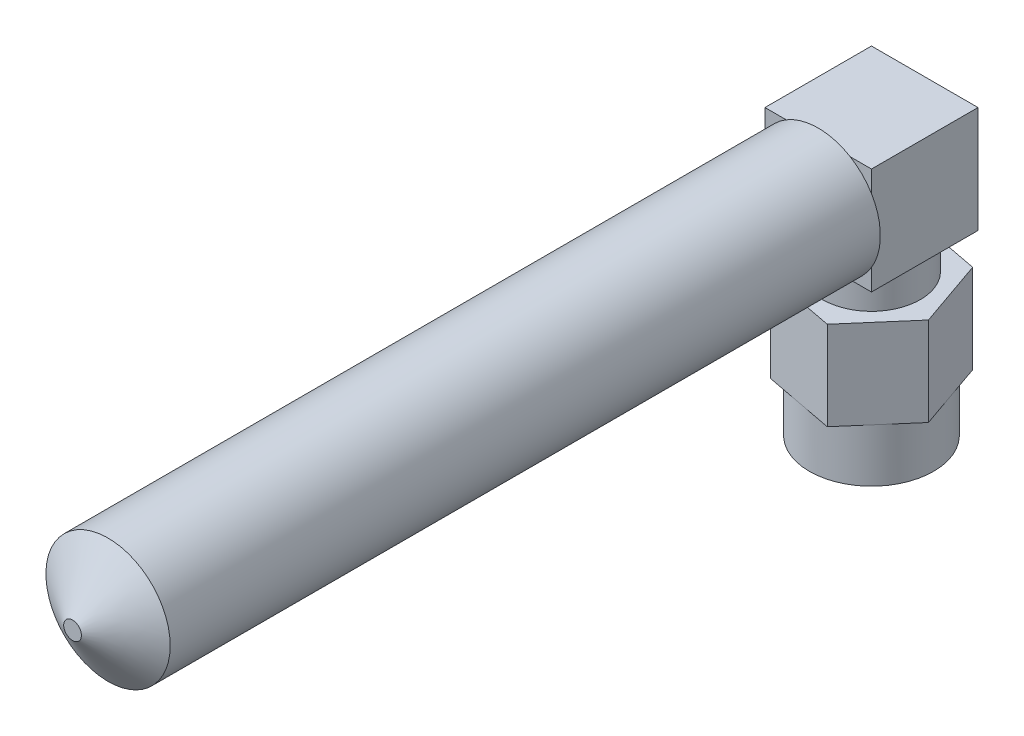
ISO-10303-21;
HEADER;
FILE_DESCRIPTION(('STEP AP214'),'2;1');
FILE_NAME('part.step','',(''),(''),'','','');
FILE_SCHEMA(('AUTOMOTIVE_DESIGN { 1 0 10303 214 1 1 1 1 }'));
ENDSEC;
DATA;
#1=APPLICATION_CONTEXT('core data for automotive mechanical design processes');
#2=APPLICATION_PROTOCOL_DEFINITION('international standard','automotive_design',2000,#1);
#3=PRODUCT_CONTEXT('',#1,'mechanical');
#4=PRODUCT('Part','Part','',(#3));
#5=PRODUCT_RELATED_PRODUCT_CATEGORY('part','',(#4));
#6=PRODUCT_DEFINITION_FORMATION('','',#4);
#7=PRODUCT_DEFINITION_CONTEXT('part definition',#1,'design');
#8=PRODUCT_DEFINITION('design','',#6,#7);
#9=PRODUCT_DEFINITION_SHAPE('','',#8);
#10=(LENGTH_UNIT() NAMED_UNIT(*) SI_UNIT(.MILLI.,.METRE.));
#11=(NAMED_UNIT(*) PLANE_ANGLE_UNIT() SI_UNIT($,.RADIAN.));
#12=(NAMED_UNIT(*) SI_UNIT($,.STERADIAN.) SOLID_ANGLE_UNIT());
#13=UNCERTAINTY_MEASURE_WITH_UNIT(LENGTH_MEASURE(1.E-05),#10,'distance_accuracy_value','');
#14=(GEOMETRIC_REPRESENTATION_CONTEXT(3) GLOBAL_UNCERTAINTY_ASSIGNED_CONTEXT((#13)) GLOBAL_UNIT_ASSIGNED_CONTEXT((#10,
#11,#12)) REPRESENTATION_CONTEXT('',''));
#15=CARTESIAN_POINT('',(0.,0.,0.));
#16=DIRECTION('',(0.,0.,1.));
#17=DIRECTION('',(1.,0.,0.));
#18=AXIS2_PLACEMENT_3D('',#15,#16,#17);
#19=CARTESIAN_POINT('',(3.,16.,3.));
#20=DIRECTION('',(0.,0.,-1.));
#21=DIRECTION('',(-1.,0.,0.));
#22=AXIS2_PLACEMENT_3D('',#19,#20,#21);
#23=PLANE('',#22);
#24=CARTESIAN_POINT('',(0.,13.,3.));
#25=DIRECTION('',(0.,0.,1.));
#26=DIRECTION('',(1.,0.,0.));
#27=AXIS2_PLACEMENT_3D('',#24,#25,#26);
#28=CIRCLE('',#27,3.5);
#29=CARTESIAN_POINT('',(3.,14.802775637732,3.));
#30=VERTEX_POINT('',#29);
#31=CARTESIAN_POINT('',(1.802775637732,16.,3.));
#32=VERTEX_POINT('',#31);
#33=EDGE_CURVE('E185',#30,#32,#28,.T.);
#34=ORIENTED_EDGE('',*,*,#33,.F.);
#35=DIRECTION('',(0.,-1.,0.));
#36=VECTOR('',#35,1.);
#37=CARTESIAN_POINT('',(3.,16.,3.));
#38=LINE('',#37,#36);
#39=CARTESIAN_POINT('',(3.,16.,3.));
#40=VERTEX_POINT('',#39);
#41=EDGE_CURVE('E166',#40,#30,#38,.T.);
#42=ORIENTED_EDGE('',*,*,#41,.F.);
#43=DIRECTION('',(1.,0.,0.));
#44=VECTOR('',#43,1.);
#45=CARTESIAN_POINT('',(3.,16.,3.));
#46=LINE('',#45,#44);
#47=EDGE_CURVE('E622',#32,#40,#46,.T.);
#48=ORIENTED_EDGE('',*,*,#47,.F.);
#49=EDGE_LOOP('',(#34,#42,#48));
#50=FACE_BOUND('',#49,.T.);
#51=ADVANCED_FACE('F36',(#50),#23,.F.);
#52=CARTESIAN_POINT('',(-1.802775637732,16.,3.));
#53=VERTEX_POINT('',#52);
#54=CARTESIAN_POINT('',(-3.,14.802775637732,3.));
#55=VERTEX_POINT('',#54);
#56=EDGE_CURVE('E11',#53,#55,#28,.T.);
#57=ORIENTED_EDGE('',*,*,#56,.F.);
#58=CARTESIAN_POINT('',(-3.,16.,3.));
#59=VERTEX_POINT('',#58);
#60=EDGE_CURVE('E621',#59,#53,#46,.T.);
#61=ORIENTED_EDGE('',*,*,#60,.F.);
#62=DIRECTION('',(0.,-1.,0.));
#63=VECTOR('',#62,1.);
#64=CARTESIAN_POINT('',(-3.,16.,3.));
#65=LINE('',#64,#63);
#66=EDGE_CURVE('E205',#59,#55,#65,.T.);
#67=ORIENTED_EDGE('',*,*,#66,.T.);
#68=EDGE_LOOP('',(#57,#61,#67));
#69=FACE_BOUND('',#68,.T.);
#70=ADVANCED_FACE('F309',(#69),#23,.F.);
#71=CARTESIAN_POINT('',(-3.,11.197224362268,3.));
#72=VERTEX_POINT('',#71);
#73=CARTESIAN_POINT('',(-1.80277563773199,10.,3.));
#74=VERTEX_POINT('',#73);
#75=EDGE_CURVE('E45',#72,#74,#28,.T.);
#76=ORIENTED_EDGE('',*,*,#75,.F.);
#77=CARTESIAN_POINT('',(-3.,10.,3.));
#78=VERTEX_POINT('',#77);
#79=EDGE_CURVE('E206',#72,#78,#65,.T.);
#80=ORIENTED_EDGE('',*,*,#79,.T.);
#81=DIRECTION('',(1.,0.,0.));
#82=VECTOR('',#81,1.);
#83=CARTESIAN_POINT('',(3.,10.,3.));
#84=LINE('',#83,#82);
#85=EDGE_CURVE('E633',#78,#74,#84,.T.);
#86=ORIENTED_EDGE('',*,*,#85,.T.);
#87=EDGE_LOOP('',(#76,#80,#86));
#88=FACE_BOUND('',#87,.T.);
#89=ADVANCED_FACE('F304',(#88),#23,.F.);
#90=CARTESIAN_POINT('',(0.,3.,0.));
#91=DIRECTION('',(0.,-1.,0.));
#92=DIRECTION('',(0.,0.,-1.));
#93=AXIS2_PLACEMENT_3D('',#90,#91,#92);
#94=CYLINDRICAL_SURFACE('',#93,3.5);
#95=CARTESIAN_POINT('',(0.,3.,0.));
#96=DIRECTION('',(0.,1.,0.));
#97=DIRECTION('',(0.,0.,1.));
#98=AXIS2_PLACEMENT_3D('',#95,#96,#97);
#99=CIRCLE('',#98,3.5);
#100=CARTESIAN_POINT('',(2.64807249743795,3.,2.28860482572084));
#101=VERTEX_POINT('',#100);
#102=CARTESIAN_POINT('',(3.30602616701688,3.,-1.14899564098375));
#103=VERTEX_POINT('',#102);
#104=EDGE_CURVE('E191',#101,#103,#99,.T.);
#105=ORIENTED_EDGE('',*,*,#104,.F.);
#106=CARTESIAN_POINT('',(-0.657953669578931,3.,3.43760046670459));
#107=VERTEX_POINT('',#106);
#108=EDGE_CURVE('E275',#107,#101,#99,.T.);
#109=ORIENTED_EDGE('',*,*,#108,.F.);
#110=CARTESIAN_POINT('',(-3.30602616701688,3.,1.14899564098375));
#111=VERTEX_POINT('',#110);
#112=EDGE_CURVE('E283',#111,#107,#99,.T.);
#113=ORIENTED_EDGE('',*,*,#112,.F.);
#114=CARTESIAN_POINT('',(-2.64807249743795,3.,-2.28860482572084));
#115=VERTEX_POINT('',#114);
#116=EDGE_CURVE('E288',#115,#111,#99,.T.);
#117=ORIENTED_EDGE('',*,*,#116,.F.);
#118=CARTESIAN_POINT('',(0.657953669578931,3.,-3.43760046670459));
#119=VERTEX_POINT('',#118);
#120=EDGE_CURVE('E281',#119,#115,#99,.T.);
#121=ORIENTED_EDGE('',*,*,#120,.F.);
#122=EDGE_CURVE('E274',#103,#119,#99,.T.);
#123=ORIENTED_EDGE('',*,*,#122,.F.);
#124=EDGE_LOOP('',(#105,#109,#113,#117,#121,#123));
#125=FACE_BOUND('',#124,.T.);
#126=CARTESIAN_POINT('',(0.,0.,0.));
#127=DIRECTION('',(0.,1.,0.));
#128=DIRECTION('',(0.,0.,1.));
#129=AXIS2_PLACEMENT_3D('',#126,#127,#128);
#130=CIRCLE('',#129,3.5);
#131=CARTESIAN_POINT('',(0.,0.,3.5));
#132=VERTEX_POINT('',#131);
#133=EDGE_CURVE('E40',#132,#132,#130,.T.);
#134=ORIENTED_EDGE('',*,*,#133,.T.);
#135=EDGE_LOOP('',(#134));
#136=FACE_BOUND('',#135,.T.);
#137=ADVANCED_FACE('F38',(#125,#136),#94,.T.);
#138=CARTESIAN_POINT('',(0.,0.,0.));
#139=DIRECTION('',(0.,1.,0.));
#140=DIRECTION('',(0.,0.,1.));
#141=AXIS2_PLACEMENT_3D('',#138,#139,#140);
#142=PLANE('',#141);
#143=CARTESIAN_POINT('',(0.,0.,0.));
#144=DIRECTION('',(0.,-1.,0.));
#145=DIRECTION('',(0.,0.,-1.));
#146=AXIS2_PLACEMENT_3D('',#143,#144,#145);
#147=CIRCLE('',#146,2.5);
#148=CARTESIAN_POINT('',(0.,0.,-2.5));
#149=VERTEX_POINT('',#148);
#150=EDGE_CURVE('E208',#149,#149,#147,.T.);
#151=ORIENTED_EDGE('',*,*,#150,.F.);
#152=EDGE_LOOP('',(#151));
#153=FACE_BOUND('',#152,.T.);
#154=ORIENTED_EDGE('',*,*,#133,.F.);
#155=EDGE_LOOP('',(#154));
#156=FACE_BOUND('',#155,.T.);
#157=ADVANCED_FACE('F293',(#153,#156),#142,.F.);
#158=CARTESIAN_POINT('',(0.,3.,0.));
#159=DIRECTION('',(0.,1.,0.));
#160=DIRECTION('',(0.,0.,1.));
#161=AXIS2_PLACEMENT_3D('',#158,#159,#160);
#162=PLANE('',#161);
#163=DIRECTION('',(0.653887093063098,0.,-0.75659214212513));
#164=VECTOR('',#163,1.);
#165=CARTESIAN_POINT('',(1.32674588523935,3.,3.81747019495029));
#166=LINE('',#165,#164);
#167=CARTESIAN_POINT('',(3.96939910963656,3.,0.759739456491395));
#168=VERTEX_POINT('',#167);
#169=EDGE_CURVE('E254',#101,#168,#166,.T.);
#170=ORIENTED_EDGE('',*,*,#169,.F.);
#171=ORIENTED_EDGE('',*,*,#104,.T.);
#172=DIRECTION('',(-0.3282844688525,0.,-0.944578904861966));
#173=VECTOR('',#172,1.);
#174=CARTESIAN_POINT('',(3.96939910963656,3.,0.759739456491395));
#175=LINE('',#174,#173);
#176=EDGE_CURVE('E235',#168,#103,#175,.T.);
#177=ORIENTED_EDGE('',*,*,#176,.F.);
#178=EDGE_LOOP('',(#170,#171,#177));
#179=FACE_BOUND('',#178,.T.);
#180=ADVANCED_FACE('F295',(#179),#162,.F.);
#181=CARTESIAN_POINT('',(2.64265322439721,3.,-3.05773073845889));
#182=VERTEX_POINT('',#181);
#183=EDGE_CURVE('E218',#103,#182,#175,.T.);
#184=ORIENTED_EDGE('',*,*,#183,.F.);
#185=ORIENTED_EDGE('',*,*,#122,.T.);
#186=DIRECTION('',(-0.982171561915597,0.,-0.187986762736838));
#187=VECTOR('',#186,1.);
#188=CARTESIAN_POINT('',(2.64265322439721,3.,-3.05773073845889));
#189=LINE('',#188,#187);
#190=EDGE_CURVE('E239',#182,#119,#189,.T.);
#191=ORIENTED_EDGE('',*,*,#190,.F.);
#192=EDGE_LOOP('',(#184,#185,#191));
#193=FACE_BOUND('',#192,.T.);
#194=ADVANCED_FACE('F301',(#193),#162,.F.);
#195=CARTESIAN_POINT('',(-1.32674588523935,3.,-3.81747019495029));
#196=VERTEX_POINT('',#195);
#197=EDGE_CURVE('E238',#119,#196,#189,.T.);
#198=ORIENTED_EDGE('',*,*,#197,.F.);
#199=ORIENTED_EDGE('',*,*,#120,.T.);
#200=DIRECTION('',(-0.653887093063097,0.,0.75659214212513));
#201=VECTOR('',#200,1.);
#202=CARTESIAN_POINT('',(-1.32674588523935,3.,-3.81747019495029));
#203=LINE('',#202,#201);
#204=EDGE_CURVE('E243',#196,#115,#203,.T.);
#205=ORIENTED_EDGE('',*,*,#204,.F.);
#206=EDGE_LOOP('',(#198,#199,#205));
#207=FACE_BOUND('',#206,.T.);
#208=ADVANCED_FACE('F352',(#207),#162,.F.);
#209=CARTESIAN_POINT('',(-3.96939910963656,3.,-0.759739456491394));
#210=VERTEX_POINT('',#209);
#211=EDGE_CURVE('E242',#115,#210,#203,.T.);
#212=ORIENTED_EDGE('',*,*,#211,.F.);
#213=ORIENTED_EDGE('',*,*,#116,.T.);
#214=DIRECTION('',(0.3282844688525,0.,0.944578904861966));
#215=VECTOR('',#214,1.);
#216=CARTESIAN_POINT('',(-3.96939910963656,3.,-0.759739456491394));
#217=LINE('',#216,#215);
#218=EDGE_CURVE('E247',#210,#111,#217,.T.);
#219=ORIENTED_EDGE('',*,*,#218,.F.);
#220=EDGE_LOOP('',(#212,#213,#219));
#221=FACE_BOUND('',#220,.T.);
#222=ADVANCED_FACE('F361',(#221),#162,.F.);
#223=CARTESIAN_POINT('',(-2.64265322439721,3.,3.05773073845889));
#224=VERTEX_POINT('',#223);
#225=EDGE_CURVE('E246',#111,#224,#217,.T.);
#226=ORIENTED_EDGE('',*,*,#225,.F.);
#227=ORIENTED_EDGE('',*,*,#112,.T.);
#228=DIRECTION('',(0.982171561915597,0.,0.187986762736837));
#229=VECTOR('',#228,1.);
#230=CARTESIAN_POINT('',(-2.64265322439721,3.,3.05773073845889));
#231=LINE('',#230,#229);
#232=EDGE_CURVE('E251',#224,#107,#231,.T.);
#233=ORIENTED_EDGE('',*,*,#232,.F.);
#234=EDGE_LOOP('',(#226,#227,#233));
#235=FACE_BOUND('',#234,.T.);
#236=ADVANCED_FACE('F370',(#235),#162,.F.);
#237=CARTESIAN_POINT('',(1.32674588523935,3.,3.81747019495029));
#238=VERTEX_POINT('',#237);
#239=EDGE_CURVE('E250',#107,#238,#231,.T.);
#240=ORIENTED_EDGE('',*,*,#239,.F.);
#241=ORIENTED_EDGE('',*,*,#108,.T.);
#242=EDGE_CURVE('E224',#238,#101,#166,.T.);
#243=ORIENTED_EDGE('',*,*,#242,.F.);
#244=EDGE_LOOP('',(#240,#241,#243));
#245=FACE_BOUND('',#244,.T.);
#246=ADVANCED_FACE('F303',(#245),#162,.F.);
#247=CARTESIAN_POINT('',(3.96939910963656,8.,0.759739456491395));
#248=DIRECTION('',(-0.944578904861966,0.,0.3282844688525));
#249=DIRECTION('',(0.3282844688525,0.,0.944578904861967));
#250=AXIS2_PLACEMENT_3D('',#247,#248,#249);
#251=PLANE('',#250);
#252=ORIENTED_EDGE('',*,*,#176,.T.);
#253=ORIENTED_EDGE('',*,*,#183,.T.);
#254=DIRECTION('',(0.,-1.,0.));
#255=VECTOR('',#254,1.);
#256=CARTESIAN_POINT('',(2.64265322439721,8.,-3.05773073845889));
#257=LINE('',#256,#255);
#258=CARTESIAN_POINT('',(2.64265322439721,8.,-3.05773073845889));
#259=VERTEX_POINT('',#258);
#260=EDGE_CURVE('E271',#259,#182,#257,.T.);
#261=ORIENTED_EDGE('',*,*,#260,.F.);
#262=DIRECTION('',(-0.3282844688525,0.,-0.944578904861966));
#263=VECTOR('',#262,1.);
#264=CARTESIAN_POINT('',(3.96939910963656,8.,0.759739456491395));
#265=LINE('',#264,#263);
#266=CARTESIAN_POINT('',(3.96939910963656,8.,0.759739456491395));
#267=VERTEX_POINT('',#266);
#268=EDGE_CURVE('E220',#267,#259,#265,.T.);
#269=ORIENTED_EDGE('',*,*,#268,.F.);
#270=DIRECTION('',(0.,-1.,0.));
#271=VECTOR('',#270,1.);
#272=CARTESIAN_POINT('',(3.96939910963656,8.,0.759739456491395));
#273=LINE('',#272,#271);
#274=EDGE_CURVE('E234',#267,#168,#273,.T.);
#275=ORIENTED_EDGE('',*,*,#274,.T.);
#276=EDGE_LOOP('',(#252,#253,#261,#269,#275));
#277=FACE_BOUND('',#276,.T.);
#278=ADVANCED_FACE('F387',(#277),#251,.F.);
#279=CARTESIAN_POINT('',(2.64265322439721,8.,-3.05773073845889));
#280=DIRECTION('',(-0.187986762736837,0.,0.982171561915597));
#281=DIRECTION('',(0.982171561915597,0.,0.187986762736837));
#282=AXIS2_PLACEMENT_3D('',#279,#280,#281);
#283=PLANE('',#282);
#284=ORIENTED_EDGE('',*,*,#190,.T.);
#285=ORIENTED_EDGE('',*,*,#197,.T.);
#286=DIRECTION('',(0.,-1.,0.));
#287=VECTOR('',#286,1.);
#288=CARTESIAN_POINT('',(-1.32674588523935,8.,-3.81747019495029));
#289=LINE('',#288,#287);
#290=CARTESIAN_POINT('',(-1.32674588523935,8.,-3.81747019495029));
#291=VERTEX_POINT('',#290);
#292=EDGE_CURVE('E268',#291,#196,#289,.T.);
#293=ORIENTED_EDGE('',*,*,#292,.F.);
#294=DIRECTION('',(-0.982171561915597,0.,-0.187986762736838));
#295=VECTOR('',#294,1.);
#296=CARTESIAN_POINT('',(2.64265322439721,8.,-3.05773073845889));
#297=LINE('',#296,#295);
#298=EDGE_CURVE('E223',#259,#291,#297,.T.);
#299=ORIENTED_EDGE('',*,*,#298,.F.);
#300=ORIENTED_EDGE('',*,*,#260,.T.);
#301=EDGE_LOOP('',(#284,#285,#293,#299,#300));
#302=FACE_BOUND('',#301,.T.);
#303=ADVANCED_FACE('F395',(#302),#283,.F.);
#304=CARTESIAN_POINT('',(-1.32674588523935,8.,-3.81747019495029));
#305=DIRECTION('',(0.75659214212513,0.,0.653887093063097));
#306=DIRECTION('',(0.653887093063097,0.,-0.75659214212513));
#307=AXIS2_PLACEMENT_3D('',#304,#305,#306);
#308=PLANE('',#307);
#309=ORIENTED_EDGE('',*,*,#204,.T.);
#310=ORIENTED_EDGE('',*,*,#211,.T.);
#311=DIRECTION('',(0.,-1.,0.));
#312=VECTOR('',#311,1.);
#313=CARTESIAN_POINT('',(-3.96939910963656,8.,-0.759739456491394));
#314=LINE('',#313,#312);
#315=CARTESIAN_POINT('',(-3.96939910963656,8.,-0.759739456491394));
#316=VERTEX_POINT('',#315);
#317=EDGE_CURVE('E265',#316,#210,#314,.T.);
#318=ORIENTED_EDGE('',*,*,#317,.F.);
#319=DIRECTION('',(-0.653887093063097,0.,0.75659214212513));
#320=VECTOR('',#319,1.);
#321=CARTESIAN_POINT('',(-1.32674588523935,8.,-3.81747019495029));
#322=LINE('',#321,#320);
#323=EDGE_CURVE('E226',#291,#316,#322,.T.);
#324=ORIENTED_EDGE('',*,*,#323,.F.);
#325=ORIENTED_EDGE('',*,*,#292,.T.);
#326=EDGE_LOOP('',(#309,#310,#318,#324,#325));
#327=FACE_BOUND('',#326,.T.);
#328=ADVANCED_FACE('F404',(#327),#308,.F.);
#329=CARTESIAN_POINT('',(-3.96939910963656,8.,-0.759739456491394));
#330=DIRECTION('',(0.944578904861966,0.,-0.3282844688525));
#331=DIRECTION('',(-0.3282844688525,0.,-0.944578904861966));
#332=AXIS2_PLACEMENT_3D('',#329,#330,#331);
#333=PLANE('',#332);
#334=ORIENTED_EDGE('',*,*,#218,.T.);
#335=ORIENTED_EDGE('',*,*,#225,.T.);
#336=DIRECTION('',(0.,-1.,0.));
#337=VECTOR('',#336,1.);
#338=CARTESIAN_POINT('',(-2.64265322439721,8.,3.05773073845889));
#339=LINE('',#338,#337);
#340=CARTESIAN_POINT('',(-2.64265322439721,8.,3.05773073845889));
#341=VERTEX_POINT('',#340);
#342=EDGE_CURVE('E262',#341,#224,#339,.T.);
#343=ORIENTED_EDGE('',*,*,#342,.F.);
#344=DIRECTION('',(0.3282844688525,0.,0.944578904861966));
#345=VECTOR('',#344,1.);
#346=CARTESIAN_POINT('',(-3.96939910963656,8.,-0.759739456491394));
#347=LINE('',#346,#345);
#348=EDGE_CURVE('E228',#316,#341,#347,.T.);
#349=ORIENTED_EDGE('',*,*,#348,.F.);
#350=ORIENTED_EDGE('',*,*,#317,.T.);
#351=EDGE_LOOP('',(#334,#335,#343,#349,#350));
#352=FACE_BOUND('',#351,.T.);
#353=ADVANCED_FACE('F414',(#352),#333,.F.);
#354=CARTESIAN_POINT('',(-2.64265322439721,8.,3.05773073845889));
#355=DIRECTION('',(0.187986762736837,0.,-0.982171561915598));
#356=DIRECTION('',(-0.982171561915597,0.,-0.187986762736837));
#357=AXIS2_PLACEMENT_3D('',#354,#355,#356);
#358=PLANE('',#357);
#359=ORIENTED_EDGE('',*,*,#232,.T.);
#360=ORIENTED_EDGE('',*,*,#239,.T.);
#361=DIRECTION('',(0.,-1.,0.));
#362=VECTOR('',#361,1.);
#363=CARTESIAN_POINT('',(1.32674588523935,8.,3.81747019495029));
#364=LINE('',#363,#362);
#365=CARTESIAN_POINT('',(1.32674588523935,8.,3.81747019495029));
#366=VERTEX_POINT('',#365);
#367=EDGE_CURVE('E259',#366,#238,#364,.T.);
#368=ORIENTED_EDGE('',*,*,#367,.F.);
#369=DIRECTION('',(0.982171561915597,0.,0.187986762736837));
#370=VECTOR('',#369,1.);
#371=CARTESIAN_POINT('',(-2.64265322439721,8.,3.05773073845889));
#372=LINE('',#371,#370);
#373=EDGE_CURVE('E230',#341,#366,#372,.T.);
#374=ORIENTED_EDGE('',*,*,#373,.F.);
#375=ORIENTED_EDGE('',*,*,#342,.T.);
#376=EDGE_LOOP('',(#359,#360,#368,#374,#375));
#377=FACE_BOUND('',#376,.T.);
#378=ADVANCED_FACE('F424',(#377),#358,.F.);
#379=CARTESIAN_POINT('',(1.32674588523935,8.,3.81747019495029));
#380=DIRECTION('',(-0.75659214212513,0.,-0.653887093063098));
#381=DIRECTION('',(-0.653887093063098,0.,0.75659214212513));
#382=AXIS2_PLACEMENT_3D('',#379,#380,#381);
#383=PLANE('',#382);
#384=ORIENTED_EDGE('',*,*,#242,.T.);
#385=ORIENTED_EDGE('',*,*,#169,.T.);
#386=ORIENTED_EDGE('',*,*,#274,.F.);
#387=DIRECTION('',(0.653887093063098,0.,-0.75659214212513));
#388=VECTOR('',#387,1.);
#389=CARTESIAN_POINT('',(1.32674588523935,8.,3.81747019495029));
#390=LINE('',#389,#388);
#391=EDGE_CURVE('E232',#366,#267,#390,.T.);
#392=ORIENTED_EDGE('',*,*,#391,.F.);
#393=ORIENTED_EDGE('',*,*,#367,.T.);
#394=EDGE_LOOP('',(#384,#385,#386,#392,#393));
#395=FACE_BOUND('',#394,.T.);
#396=ADVANCED_FACE('F434',(#395),#383,.F.);
#397=CARTESIAN_POINT('',(0.,8.,0.));
#398=DIRECTION('',(0.,1.,0.));
#399=DIRECTION('',(0.,0.,1.));
#400=AXIS2_PLACEMENT_3D('',#397,#398,#399);
#401=PLANE('',#400);
#402=CARTESIAN_POINT('',(0.,8.,0.));
#403=DIRECTION('',(0.,1.,0.));
#404=DIRECTION('',(0.,0.,1.));
#405=AXIS2_PLACEMENT_3D('',#402,#403,#404);
#406=CIRCLE('',#405,2.75);
#407=CARTESIAN_POINT('',(0.,8.,2.75));
#408=VERTEX_POINT('',#407);
#409=EDGE_CURVE('E189',#408,#408,#406,.T.);
#410=ORIENTED_EDGE('',*,*,#409,.F.);
#411=EDGE_LOOP('',(#410));
#412=FACE_BOUND('',#411,.T.);
#413=ORIENTED_EDGE('',*,*,#268,.T.);
#414=ORIENTED_EDGE('',*,*,#298,.T.);
#415=ORIENTED_EDGE('',*,*,#323,.T.);
#416=ORIENTED_EDGE('',*,*,#348,.T.);
#417=ORIENTED_EDGE('',*,*,#373,.T.);
#418=ORIENTED_EDGE('',*,*,#391,.T.);
#419=EDGE_LOOP('',(#413,#414,#415,#416,#417,#418));
#420=FACE_BOUND('',#419,.T.);
#421=ADVANCED_FACE('F444',(#412,#420),#401,.T.);
#422=CARTESIAN_POINT('',(0.,10.,0.));
#423=DIRECTION('',(0.,-1.,0.));
#424=DIRECTION('',(0.,0.,-1.));
#425=AXIS2_PLACEMENT_3D('',#422,#423,#424);
#426=CYLINDRICAL_SURFACE('',#425,2.75);
#427=CARTESIAN_POINT('',(0.,10.,0.));
#428=DIRECTION('',(0.,1.,0.));
#429=DIRECTION('',(0.,0.,1.));
#430=AXIS2_PLACEMENT_3D('',#427,#428,#429);
#431=CIRCLE('',#430,2.75);
#432=CARTESIAN_POINT('',(0.,10.,2.75));
#433=VERTEX_POINT('',#432);
#434=EDGE_CURVE('E214',#433,#433,#431,.T.);
#435=ORIENTED_EDGE('',*,*,#434,.F.);
#436=EDGE_LOOP('',(#435));
#437=FACE_BOUND('',#436,.T.);
#438=ORIENTED_EDGE('',*,*,#409,.T.);
#439=EDGE_LOOP('',(#438));
#440=FACE_BOUND('',#439,.T.);
#441=ADVANCED_FACE('F454',(#437,#440),#426,.T.);
#442=CARTESIAN_POINT('',(0.,5.,0.));
#443=DIRECTION('',(0.,-1.,0.));
#444=DIRECTION('',(0.,0.,-1.));
#445=AXIS2_PLACEMENT_3D('',#442,#443,#444);
#446=CYLINDRICAL_SURFACE('',#445,2.5);
#447=CARTESIAN_POINT('',(0.,5.,0.));
#448=DIRECTION('',(0.,-1.,0.));
#449=DIRECTION('',(0.,0.,-1.));
#450=AXIS2_PLACEMENT_3D('',#447,#448,#449);
#451=CIRCLE('',#450,2.5);
#452=CARTESIAN_POINT('',(0.,5.,-2.5));
#453=VERTEX_POINT('',#452);
#454=EDGE_CURVE('E211',#453,#453,#451,.T.);
#455=ORIENTED_EDGE('',*,*,#454,.F.);
#456=EDGE_LOOP('',(#455));
#457=FACE_BOUND('',#456,.T.);
#458=ORIENTED_EDGE('',*,*,#150,.T.);
#459=EDGE_LOOP('',(#458));
#460=FACE_BOUND('',#459,.T.);
#461=ADVANCED_FACE('F463',(#457,#460),#446,.F.);
#462=CARTESIAN_POINT('',(0.,5.,0.));
#463=DIRECTION('',(0.,-1.,0.));
#464=DIRECTION('',(0.,0.,-1.));
#465=AXIS2_PLACEMENT_3D('',#462,#463,#464);
#466=PLANE('',#465);
#467=ORIENTED_EDGE('',*,*,#454,.T.);
#468=EDGE_LOOP('',(#467));
#469=FACE_BOUND('',#468,.T.);
#470=ADVANCED_FACE('F325',(#469),#466,.T.);
#471=CARTESIAN_POINT('',(-3.,16.,3.));
#472=DIRECTION('',(1.,0.,0.));
#473=DIRECTION('',(0.,0.,-1.));
#474=AXIS2_PLACEMENT_3D('',#471,#472,#473);
#475=PLANE('',#474);
#476=DIRECTION('',(0.,0.,1.));
#477=VECTOR('',#476,1.);
#478=CARTESIAN_POINT('',(-3.,10.,3.));
#479=LINE('',#478,#477);
#480=CARTESIAN_POINT('',(-3.,10.,-3.));
#481=VERTEX_POINT('',#480);
#482=EDGE_CURVE('E198',#481,#78,#479,.T.);
#483=ORIENTED_EDGE('',*,*,#482,.T.);
#484=ORIENTED_EDGE('',*,*,#79,.F.);
#485=EDGE_CURVE('E60',#55,#72,#65,.T.);
#486=ORIENTED_EDGE('',*,*,#485,.F.);
#487=ORIENTED_EDGE('',*,*,#66,.F.);
#488=DIRECTION('',(0.,0.,1.));
#489=VECTOR('',#488,1.);
#490=CARTESIAN_POINT('',(-3.,16.,3.));
#491=LINE('',#490,#489);
#492=CARTESIAN_POINT('',(-3.,16.,-3.));
#493=VERTEX_POINT('',#492);
#494=EDGE_CURVE('E625',#493,#59,#491,.T.);
#495=ORIENTED_EDGE('',*,*,#494,.F.);
#496=DIRECTION('',(0.,-1.,0.));
#497=VECTOR('',#496,1.);
#498=CARTESIAN_POINT('',(-3.,16.,-3.));
#499=LINE('',#498,#497);
#500=EDGE_CURVE('E630',#493,#481,#499,.T.);
#501=ORIENTED_EDGE('',*,*,#500,.T.);
#502=EDGE_LOOP('',(#483,#484,#486,#487,#495,#501));
#503=FACE_BOUND('',#502,.T.);
#504=ADVANCED_FACE('F319',(#503),#475,.F.);
#505=CARTESIAN_POINT('',(1.80277563773199,10.,3.));
#506=VERTEX_POINT('',#505);
#507=CARTESIAN_POINT('',(3.,11.197224362268,3.));
#508=VERTEX_POINT('',#507);
#509=EDGE_CURVE('E174',#506,#508,#28,.T.);
#510=ORIENTED_EDGE('',*,*,#509,.F.);
#511=CARTESIAN_POINT('',(3.,10.,3.));
#512=VERTEX_POINT('',#511);
#513=EDGE_CURVE('E176',#506,#512,#84,.T.);
#514=ORIENTED_EDGE('',*,*,#513,.T.);
#515=EDGE_CURVE('E162',#508,#512,#38,.T.);
#516=ORIENTED_EDGE('',*,*,#515,.F.);
#517=EDGE_LOOP('',(#510,#514,#516));
#518=FACE_BOUND('',#517,.T.);
#519=ADVANCED_FACE('F172',(#518),#23,.F.);
#520=CARTESIAN_POINT('',(3.,16.,3.));
#521=DIRECTION('',(-1.,0.,0.));
#522=DIRECTION('',(0.,0.,1.));
#523=AXIS2_PLACEMENT_3D('',#520,#521,#522);
#524=PLANE('',#523);
#525=DIRECTION('',(0.,0.,-1.));
#526=VECTOR('',#525,1.);
#527=CARTESIAN_POINT('',(3.,10.,3.));
#528=LINE('',#527,#526);
#529=CARTESIAN_POINT('',(3.,10.,-3.));
#530=VERTEX_POINT('',#529);
#531=EDGE_CURVE('E635',#512,#530,#528,.T.);
#532=ORIENTED_EDGE('',*,*,#531,.T.);
#533=DIRECTION('',(0.,-1.,0.));
#534=VECTOR('',#533,1.);
#535=CARTESIAN_POINT('',(3.,16.,-3.));
#536=LINE('',#535,#534);
#537=CARTESIAN_POINT('',(3.,16.,-3.));
#538=VERTEX_POINT('',#537);
#539=EDGE_CURVE('E178',#538,#530,#536,.T.);
#540=ORIENTED_EDGE('',*,*,#539,.F.);
#541=DIRECTION('',(0.,0.,-1.));
#542=VECTOR('',#541,1.);
#543=CARTESIAN_POINT('',(3.,16.,3.));
#544=LINE('',#543,#542);
#545=EDGE_CURVE('E624',#40,#538,#544,.T.);
#546=ORIENTED_EDGE('',*,*,#545,.F.);
#547=ORIENTED_EDGE('',*,*,#41,.T.);
#548=EDGE_CURVE('E159',#30,#508,#38,.T.);
#549=ORIENTED_EDGE('',*,*,#548,.T.);
#550=ORIENTED_EDGE('',*,*,#515,.T.);
#551=EDGE_LOOP('',(#532,#540,#546,#547,#549,#550));
#552=FACE_BOUND('',#551,.T.);
#553=ADVANCED_FACE('F161',(#552),#524,.F.);
#554=CARTESIAN_POINT('',(3.,16.,-3.));
#555=DIRECTION('',(0.,0.,1.));
#556=DIRECTION('',(1.,0.,0.));
#557=AXIS2_PLACEMENT_3D('',#554,#555,#556);
#558=PLANE('',#557);
#559=DIRECTION('',(-1.,0.,0.));
#560=VECTOR('',#559,1.);
#561=CARTESIAN_POINT('',(3.,10.,-3.));
#562=LINE('',#561,#560);
#563=EDGE_CURVE('E638',#530,#481,#562,.T.);
#564=ORIENTED_EDGE('',*,*,#563,.T.);
#565=ORIENTED_EDGE('',*,*,#500,.F.);
#566=DIRECTION('',(-1.,0.,0.));
#567=VECTOR('',#566,1.);
#568=CARTESIAN_POINT('',(3.,16.,-3.));
#569=LINE('',#568,#567);
#570=EDGE_CURVE('E628',#538,#493,#569,.T.);
#571=ORIENTED_EDGE('',*,*,#570,.F.);
#572=ORIENTED_EDGE('',*,*,#539,.T.);
#573=EDGE_LOOP('',(#564,#565,#571,#572));
#574=FACE_BOUND('',#573,.T.);
#575=ADVANCED_FACE('F324',(#574),#558,.F.);
#576=CARTESIAN_POINT('',(0.,16.,0.));
#577=DIRECTION('',(0.,1.,0.));
#578=DIRECTION('',(0.,0.,1.));
#579=AXIS2_PLACEMENT_3D('',#576,#577,#578);
#580=PLANE('',#579);
#581=ORIENTED_EDGE('',*,*,#494,.T.);
#582=ORIENTED_EDGE('',*,*,#60,.T.);
#583=EDGE_CURVE('E619',#53,#32,#46,.T.);
#584=ORIENTED_EDGE('',*,*,#583,.T.);
#585=ORIENTED_EDGE('',*,*,#47,.T.);
#586=ORIENTED_EDGE('',*,*,#545,.T.);
#587=ORIENTED_EDGE('',*,*,#570,.T.);
#588=EDGE_LOOP('',(#581,#582,#584,#585,#586,#587));
#589=FACE_BOUND('',#588,.T.);
#590=ADVANCED_FACE('F495',(#589),#580,.T.);
#591=CARTESIAN_POINT('',(0.,10.,0.));
#592=DIRECTION('',(0.,1.,0.));
#593=DIRECTION('',(0.,0.,1.));
#594=AXIS2_PLACEMENT_3D('',#591,#592,#593);
#595=PLANE('',#594);
#596=ORIENTED_EDGE('',*,*,#434,.T.);
#597=EDGE_LOOP('',(#596));
#598=FACE_BOUND('',#597,.T.);
#599=ORIENTED_EDGE('',*,*,#482,.F.);
#600=ORIENTED_EDGE('',*,*,#563,.F.);
#601=ORIENTED_EDGE('',*,*,#531,.F.);
#602=ORIENTED_EDGE('',*,*,#513,.F.);
#603=EDGE_CURVE('E636',#74,#506,#84,.T.);
#604=ORIENTED_EDGE('',*,*,#603,.F.);
#605=ORIENTED_EDGE('',*,*,#85,.F.);
#606=EDGE_LOOP('',(#599,#600,#601,#602,#604,#605));
#607=FACE_BOUND('',#606,.T.);
#608=ADVANCED_FACE('F516',(#598,#607),#595,.F.);
#609=CARTESIAN_POINT('',(0.,13.,3.));
#610=DIRECTION('',(0.,0.,1.));
#611=DIRECTION('',(1.,0.,0.));
#612=AXIS2_PLACEMENT_3D('',#609,#610,#611);
#613=PLANE('',#612);
#614=EDGE_CURVE('E183',#74,#506,#28,.T.);
#615=ORIENTED_EDGE('',*,*,#614,.F.);
#616=ORIENTED_EDGE('',*,*,#603,.T.);
#617=EDGE_LOOP('',(#615,#616));
#618=FACE_BOUND('',#617,.T.);
#619=ADVANCED_FACE('F521',(#618),#613,.F.);
#620=ORIENTED_EDGE('',*,*,#548,.F.);
#621=EDGE_CURVE('E179',#508,#30,#28,.T.);
#622=ORIENTED_EDGE('',*,*,#621,.F.);
#623=EDGE_LOOP('',(#620,#622));
#624=FACE_BOUND('',#623,.T.);
#625=ADVANCED_FACE('F180',(#624),#613,.F.);
#626=EDGE_CURVE('E199',#55,#72,#28,.T.);
#627=ORIENTED_EDGE('',*,*,#626,.F.);
#628=ORIENTED_EDGE('',*,*,#485,.T.);
#629=EDGE_LOOP('',(#627,#628));
#630=FACE_BOUND('',#629,.T.);
#631=ADVANCED_FACE('F204',(#630),#613,.F.);
#632=CARTESIAN_POINT('',(0.,13.,43.));
#633=DIRECTION('',(0.,0.,-1.));
#634=DIRECTION('',(-1.,0.,0.));
#635=AXIS2_PLACEMENT_3D('',#632,#633,#634);
#636=CYLINDRICAL_SURFACE('',#635,3.5);
#637=CARTESIAN_POINT('',(0.,13.,43.));
#638=DIRECTION('',(0.,0.,1.));
#639=DIRECTION('',(1.,0.,0.));
#640=AXIS2_PLACEMENT_3D('',#637,#638,#639);
#641=CIRCLE('',#640,3.5);
#642=CARTESIAN_POINT('',(3.5,13.,43.));
#643=VERTEX_POINT('',#642);
#644=EDGE_CURVE('E195',#643,#643,#641,.T.);
#645=ORIENTED_EDGE('',*,*,#644,.F.);
#646=EDGE_LOOP('',(#645));
#647=FACE_BOUND('',#646,.T.);
#648=ORIENTED_EDGE('',*,*,#33,.T.);
#649=EDGE_CURVE('E47',#32,#53,#28,.T.);
#650=ORIENTED_EDGE('',*,*,#649,.T.);
#651=ORIENTED_EDGE('',*,*,#56,.T.);
#652=ORIENTED_EDGE('',*,*,#626,.T.);
#653=ORIENTED_EDGE('',*,*,#75,.T.);
#654=ORIENTED_EDGE('',*,*,#614,.T.);
#655=ORIENTED_EDGE('',*,*,#509,.T.);
#656=ORIENTED_EDGE('',*,*,#621,.T.);
#657=EDGE_LOOP('',(#648,#650,#651,#652,#653,#654,#655,#656));
#658=FACE_BOUND('',#657,.T.);
#659=ADVANCED_FACE('F187',(#647,#658),#636,.T.);
#660=ORIENTED_EDGE('',*,*,#583,.F.);
#661=ORIENTED_EDGE('',*,*,#649,.F.);
#662=EDGE_LOOP('',(#660,#661));
#663=FACE_BOUND('',#662,.T.);
#664=ADVANCED_FACE('F552',(#663),#613,.F.);
#665=CARTESIAN_POINT('',(0.,13.,43.));
#666=DIRECTION('',(0.,0.,-1.));
#667=DIRECTION('',(-1.,0.,0.));
#668=AXIS2_PLACEMENT_3D('',#665,#666,#667);
#669=CONICAL_SURFACE('',#668,3.5,0.982793723247328);
#670=CARTESIAN_POINT('',(0.,13.,45.));
#671=DIRECTION('',(0.,0.,1.));
#672=DIRECTION('',(1.,0.,0.));
#673=AXIS2_PLACEMENT_3D('',#670,#671,#672);
#674=CIRCLE('',#673,0.5);
#675=CARTESIAN_POINT('',(0.5,13.,45.));
#676=VERTEX_POINT('',#675);
#677=EDGE_CURVE('E184',#676,#676,#674,.T.);
#678=ORIENTED_EDGE('',*,*,#677,.F.);
#679=EDGE_LOOP('',(#678));
#680=FACE_BOUND('',#679,.T.);
#681=ORIENTED_EDGE('',*,*,#644,.T.);
#682=EDGE_LOOP('',(#681));
#683=FACE_BOUND('',#682,.T.);
#684=ADVANCED_FACE('F575',(#680,#683),#669,.T.);
#685=CARTESIAN_POINT('',(0.,13.,45.));
#686=DIRECTION('',(0.,0.,-1.));
#687=DIRECTION('',(-1.,0.,0.));
#688=AXIS2_PLACEMENT_3D('',#685,#686,#687);
#689=PLANE('',#688);
#690=ORIENTED_EDGE('',*,*,#677,.T.);
#691=EDGE_LOOP('',(#690));
#692=FACE_BOUND('',#691,.T.);
#693=ADVANCED_FACE('F583',(#692),#689,.F.);
#694=CLOSED_SHELL('',(#51,#70,#89,#137,#157,#180,#194,#208,#222,#236,#246,#278,#303,#328,#353,
#378,#396,#421,#441,#461,#470,#504,#519,#553,#575,#590,#608,#619,#625,#631,#659,#664,#684,#693));
#695=MANIFOLD_SOLID_BREP('B2',#694);
#696=ADVANCED_BREP_SHAPE_REPRESENTATION('',(#18,#695),#14);
#697=SHAPE_DEFINITION_REPRESENTATION(#9,#696);
ENDSEC;
END-ISO-10303-21;
